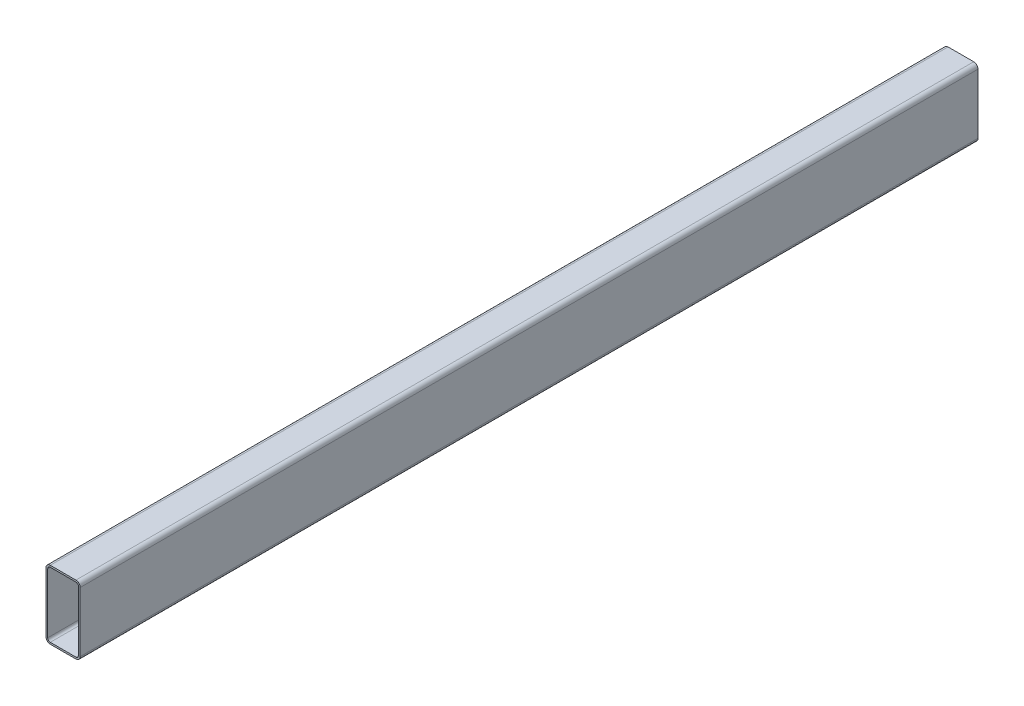
ISO-10303-21;
HEADER;
FILE_DESCRIPTION(('STEP AP214'),'2;1');
FILE_NAME('part.step','',(''),(''),'','','');
FILE_SCHEMA(('AUTOMOTIVE_DESIGN { 1 0 10303 214 1 1 1 1 }'));
ENDSEC;
DATA;
#1=APPLICATION_CONTEXT('core data for automotive mechanical design processes');
#2=APPLICATION_PROTOCOL_DEFINITION('international standard','automotive_design',2000,#1);
#3=PRODUCT_CONTEXT('',#1,'mechanical');
#4=PRODUCT('Part','Part','',(#3));
#5=PRODUCT_RELATED_PRODUCT_CATEGORY('part','',(#4));
#6=PRODUCT_DEFINITION_FORMATION('','',#4);
#7=PRODUCT_DEFINITION_CONTEXT('part definition',#1,'design');
#8=PRODUCT_DEFINITION('design','',#6,#7);
#9=PRODUCT_DEFINITION_SHAPE('','',#8);
#10=(LENGTH_UNIT() NAMED_UNIT(*) SI_UNIT(.MILLI.,.METRE.));
#11=(NAMED_UNIT(*) PLANE_ANGLE_UNIT() SI_UNIT($,.RADIAN.));
#12=(NAMED_UNIT(*) SI_UNIT($,.STERADIAN.) SOLID_ANGLE_UNIT());
#13=UNCERTAINTY_MEASURE_WITH_UNIT(LENGTH_MEASURE(1.E-05),#10,'distance_accuracy_value','');
#14=(GEOMETRIC_REPRESENTATION_CONTEXT(3) GLOBAL_UNCERTAINTY_ASSIGNED_CONTEXT((#13)) GLOBAL_UNIT_ASSIGNED_CONTEXT((#10,
#11,#12)) REPRESENTATION_CONTEXT('',''));
#15=CARTESIAN_POINT('',(0.,0.,0.));
#16=DIRECTION('',(0.,0.,1.));
#17=DIRECTION('',(1.,0.,0.));
#18=AXIS2_PLACEMENT_3D('',#15,#16,#17);
#19=CARTESIAN_POINT('',(15.,-35.,1050.));
#20=DIRECTION('',(0.,0.,1.));
#21=DIRECTION('',(1.,0.,0.));
#22=AXIS2_PLACEMENT_3D('',#19,#20,#21);
#23=PLANE('',#22);
#24=CARTESIAN_POINT('',(15.,-35.,1050.));
#25=DIRECTION('',(0.,0.,1.));
#26=DIRECTION('',(1.,0.,0.));
#27=AXIS2_PLACEMENT_3D('',#24,#25,#26);
#28=CIRCLE('',#27,5.);
#29=CARTESIAN_POINT('',(15.,-40.,1050.));
#30=VERTEX_POINT('',#29);
#31=CARTESIAN_POINT('',(20.,-35.,1050.));
#32=VERTEX_POINT('',#31);
#33=EDGE_CURVE('E213',#30,#32,#28,.T.);
#34=ORIENTED_EDGE('',*,*,#33,.T.);
#35=DIRECTION('',(0.,1.,0.));
#36=VECTOR('',#35,1.);
#37=CARTESIAN_POINT('',(20.,-35.,1050.));
#38=LINE('',#37,#36);
#39=CARTESIAN_POINT('',(20.,35.,1050.));
#40=VERTEX_POINT('',#39);
#41=EDGE_CURVE('E216',#32,#40,#38,.T.);
#42=ORIENTED_EDGE('',*,*,#41,.T.);
#43=CARTESIAN_POINT('',(15.,35.,1050.));
#44=DIRECTION('',(0.,0.,1.));
#45=DIRECTION('',(-1.,0.,0.));
#46=AXIS2_PLACEMENT_3D('',#43,#44,#45);
#47=CIRCLE('',#46,5.);
#48=CARTESIAN_POINT('',(15.,40.,1050.));
#49=VERTEX_POINT('',#48);
#50=EDGE_CURVE('E219',#40,#49,#47,.T.);
#51=ORIENTED_EDGE('',*,*,#50,.T.);
#52=DIRECTION('',(-1.,0.,0.));
#53=VECTOR('',#52,1.);
#54=CARTESIAN_POINT('',(-15.,40.,1050.));
#55=LINE('',#54,#53);
#56=CARTESIAN_POINT('',(-15.,40.,1050.));
#57=VERTEX_POINT('',#56);
#58=EDGE_CURVE('E221',#49,#57,#55,.T.);
#59=ORIENTED_EDGE('',*,*,#58,.T.);
#60=CARTESIAN_POINT('',(-15.,35.,1050.));
#61=DIRECTION('',(0.,0.,1.));
#62=DIRECTION('',(-1.,0.,0.));
#63=AXIS2_PLACEMENT_3D('',#60,#61,#62);
#64=CIRCLE('',#63,5.);
#65=CARTESIAN_POINT('',(-20.,35.,1050.));
#66=VERTEX_POINT('',#65);
#67=EDGE_CURVE('E223',#57,#66,#64,.T.);
#68=ORIENTED_EDGE('',*,*,#67,.T.);
#69=DIRECTION('',(0.,-1.,0.));
#70=VECTOR('',#69,1.);
#71=CARTESIAN_POINT('',(-20.,-35.,1050.));
#72=LINE('',#71,#70);
#73=CARTESIAN_POINT('',(-20.,-35.,1050.));
#74=VERTEX_POINT('',#73);
#75=EDGE_CURVE('E225',#66,#74,#72,.T.);
#76=ORIENTED_EDGE('',*,*,#75,.T.);
#77=CARTESIAN_POINT('',(-15.,-35.,1050.));
#78=DIRECTION('',(0.,0.,1.));
#79=DIRECTION('',(-1.,0.,0.));
#80=AXIS2_PLACEMENT_3D('',#77,#78,#79);
#81=CIRCLE('',#80,5.);
#82=CARTESIAN_POINT('',(-15.,-40.,1050.));
#83=VERTEX_POINT('',#82);
#84=EDGE_CURVE('E227',#74,#83,#81,.T.);
#85=ORIENTED_EDGE('',*,*,#84,.T.);
#86=DIRECTION('',(1.,0.,0.));
#87=VECTOR('',#86,1.);
#88=CARTESIAN_POINT('',(-15.,-40.,1050.));
#89=LINE('',#88,#87);
#90=EDGE_CURVE('E229',#83,#30,#89,.T.);
#91=ORIENTED_EDGE('',*,*,#90,.T.);
#92=EDGE_LOOP('',(#34,#42,#51,#59,#68,#76,#85,#91));
#93=FACE_BOUND('',#92,.T.);
#94=DIRECTION('',(1.,0.,0.));
#95=VECTOR('',#94,1.);
#96=CARTESIAN_POINT('',(-15.,-38.,1050.));
#97=LINE('',#96,#95);
#98=CARTESIAN_POINT('',(-15.,-38.,1050.));
#99=VERTEX_POINT('',#98);
#100=CARTESIAN_POINT('',(15.,-38.,1050.));
#101=VERTEX_POINT('',#100);
#102=EDGE_CURVE('E156',#99,#101,#97,.T.);
#103=ORIENTED_EDGE('',*,*,#102,.F.);
#104=CARTESIAN_POINT('',(-15.,-35.,1050.));
#105=DIRECTION('',(0.,0.,1.));
#106=DIRECTION('',(-1.,0.,0.));
#107=AXIS2_PLACEMENT_3D('',#104,#105,#106);
#108=CIRCLE('',#107,3.);
#109=CARTESIAN_POINT('',(-18.,-35.,1050.));
#110=VERTEX_POINT('',#109);
#111=EDGE_CURVE('E148',#110,#99,#108,.T.);
#112=ORIENTED_EDGE('',*,*,#111,.F.);
#113=DIRECTION('',(0.,-1.,0.));
#114=VECTOR('',#113,1.);
#115=CARTESIAN_POINT('',(-18.,-35.,1050.));
#116=LINE('',#115,#114);
#117=CARTESIAN_POINT('',(-18.,35.,1050.));
#118=VERTEX_POINT('',#117);
#119=EDGE_CURVE('E181',#118,#110,#116,.T.);
#120=ORIENTED_EDGE('',*,*,#119,.F.);
#121=CARTESIAN_POINT('',(-15.,35.,1050.));
#122=DIRECTION('',(0.,0.,1.));
#123=DIRECTION('',(-1.,0.,0.));
#124=AXIS2_PLACEMENT_3D('',#121,#122,#123);
#125=CIRCLE('',#124,3.);
#126=CARTESIAN_POINT('',(-15.,38.,1050.));
#127=VERTEX_POINT('',#126);
#128=EDGE_CURVE('E179',#127,#118,#125,.T.);
#129=ORIENTED_EDGE('',*,*,#128,.F.);
#130=DIRECTION('',(-1.,0.,0.));
#131=VECTOR('',#130,1.);
#132=CARTESIAN_POINT('',(-15.,38.,1050.));
#133=LINE('',#132,#131);
#134=CARTESIAN_POINT('',(15.,38.,1050.));
#135=VERTEX_POINT('',#134);
#136=EDGE_CURVE('E177',#135,#127,#133,.T.);
#137=ORIENTED_EDGE('',*,*,#136,.F.);
#138=CARTESIAN_POINT('',(15.,35.,1050.));
#139=DIRECTION('',(0.,0.,1.));
#140=DIRECTION('',(-1.,0.,0.));
#141=AXIS2_PLACEMENT_3D('',#138,#139,#140);
#142=CIRCLE('',#141,3.);
#143=CARTESIAN_POINT('',(18.,35.,1050.));
#144=VERTEX_POINT('',#143);
#145=EDGE_CURVE('E175',#144,#135,#142,.T.);
#146=ORIENTED_EDGE('',*,*,#145,.F.);
#147=DIRECTION('',(0.,1.,0.));
#148=VECTOR('',#147,1.);
#149=CARTESIAN_POINT('',(18.,-35.,1050.));
#150=LINE('',#149,#148);
#151=CARTESIAN_POINT('',(18.,-35.,1050.));
#152=VERTEX_POINT('',#151);
#153=EDGE_CURVE('E171',#152,#144,#150,.T.);
#154=ORIENTED_EDGE('',*,*,#153,.F.);
#155=CARTESIAN_POINT('',(15.,-35.,1050.));
#156=DIRECTION('',(0.,0.,1.));
#157=DIRECTION('',(1.,0.,0.));
#158=AXIS2_PLACEMENT_3D('',#155,#156,#157);
#159=CIRCLE('',#158,3.);
#160=EDGE_CURVE('E169',#101,#152,#159,.T.);
#161=ORIENTED_EDGE('',*,*,#160,.F.);
#162=EDGE_LOOP('',(#103,#112,#120,#129,#137,#146,#154,#161));
#163=FACE_BOUND('',#162,.T.);
#164=ADVANCED_FACE('F35',(#93,#163),#23,.T.);
#165=CARTESIAN_POINT('',(15.,-35.,0.));
#166=DIRECTION('',(0.,0.,1.));
#167=DIRECTION('',(1.,0.,0.));
#168=AXIS2_PLACEMENT_3D('',#165,#166,#167);
#169=PLANE('',#168);
#170=CARTESIAN_POINT('',(15.,-35.,0.));
#171=DIRECTION('',(0.,0.,1.));
#172=DIRECTION('',(1.,0.,0.));
#173=AXIS2_PLACEMENT_3D('',#170,#171,#172);
#174=CIRCLE('',#173,5.);
#175=CARTESIAN_POINT('',(15.,-40.,0.));
#176=VERTEX_POINT('',#175);
#177=CARTESIAN_POINT('',(20.,-35.,0.));
#178=VERTEX_POINT('',#177);
#179=EDGE_CURVE('E164',#176,#178,#174,.T.);
#180=ORIENTED_EDGE('',*,*,#179,.F.);
#181=DIRECTION('',(1.,0.,0.));
#182=VECTOR('',#181,1.);
#183=CARTESIAN_POINT('',(-15.,-40.,0.));
#184=LINE('',#183,#182);
#185=CARTESIAN_POINT('',(-15.,-40.,0.));
#186=VERTEX_POINT('',#185);
#187=EDGE_CURVE('E217',#186,#176,#184,.T.);
#188=ORIENTED_EDGE('',*,*,#187,.F.);
#189=CARTESIAN_POINT('',(-15.,-35.,0.));
#190=DIRECTION('',(0.,0.,1.));
#191=DIRECTION('',(-1.,0.,0.));
#192=AXIS2_PLACEMENT_3D('',#189,#190,#191);
#193=CIRCLE('',#192,5.);
#194=CARTESIAN_POINT('',(-20.,-35.,0.));
#195=VERTEX_POINT('',#194);
#196=EDGE_CURVE('E244',#195,#186,#193,.T.);
#197=ORIENTED_EDGE('',*,*,#196,.F.);
#198=DIRECTION('',(0.,-1.,0.));
#199=VECTOR('',#198,1.);
#200=CARTESIAN_POINT('',(-20.,-35.,0.));
#201=LINE('',#200,#199);
#202=CARTESIAN_POINT('',(-20.,35.,0.));
#203=VERTEX_POINT('',#202);
#204=EDGE_CURVE('E242',#203,#195,#201,.T.);
#205=ORIENTED_EDGE('',*,*,#204,.F.);
#206=CARTESIAN_POINT('',(-15.,35.,0.));
#207=DIRECTION('',(0.,0.,1.));
#208=DIRECTION('',(-1.,0.,0.));
#209=AXIS2_PLACEMENT_3D('',#206,#207,#208);
#210=CIRCLE('',#209,5.);
#211=CARTESIAN_POINT('',(-15.,40.,0.));
#212=VERTEX_POINT('',#211);
#213=EDGE_CURVE('E240',#212,#203,#210,.T.);
#214=ORIENTED_EDGE('',*,*,#213,.F.);
#215=DIRECTION('',(-1.,0.,0.));
#216=VECTOR('',#215,1.);
#217=CARTESIAN_POINT('',(-15.,40.,0.));
#218=LINE('',#217,#216);
#219=CARTESIAN_POINT('',(15.,40.,0.));
#220=VERTEX_POINT('',#219);
#221=EDGE_CURVE('E238',#220,#212,#218,.T.);
#222=ORIENTED_EDGE('',*,*,#221,.F.);
#223=CARTESIAN_POINT('',(15.,35.,0.));
#224=DIRECTION('',(0.,0.,1.));
#225=DIRECTION('',(-1.,0.,0.));
#226=AXIS2_PLACEMENT_3D('',#223,#224,#225);
#227=CIRCLE('',#226,5.);
#228=CARTESIAN_POINT('',(20.,35.,0.));
#229=VERTEX_POINT('',#228);
#230=EDGE_CURVE('E236',#229,#220,#227,.T.);
#231=ORIENTED_EDGE('',*,*,#230,.F.);
#232=DIRECTION('',(0.,1.,0.));
#233=VECTOR('',#232,1.);
#234=CARTESIAN_POINT('',(20.,-35.,0.));
#235=LINE('',#234,#233);
#236=EDGE_CURVE('E234',#178,#229,#235,.T.);
#237=ORIENTED_EDGE('',*,*,#236,.F.);
#238=EDGE_LOOP('',(#180,#188,#197,#205,#214,#222,#231,#237));
#239=FACE_BOUND('',#238,.T.);
#240=CARTESIAN_POINT('',(-15.,-35.,0.));
#241=DIRECTION('',(0.,0.,1.));
#242=DIRECTION('',(-1.,0.,0.));
#243=AXIS2_PLACEMENT_3D('',#240,#241,#242);
#244=CIRCLE('',#243,3.);
#245=CARTESIAN_POINT('',(-18.,-35.,0.));
#246=VERTEX_POINT('',#245);
#247=CARTESIAN_POINT('',(-15.,-38.,0.));
#248=VERTEX_POINT('',#247);
#249=EDGE_CURVE('E58',#246,#248,#244,.T.);
#250=ORIENTED_EDGE('',*,*,#249,.T.);
#251=DIRECTION('',(1.,0.,0.));
#252=VECTOR('',#251,1.);
#253=CARTESIAN_POINT('',(-15.,-38.,0.));
#254=LINE('',#253,#252);
#255=CARTESIAN_POINT('',(15.,-38.,0.));
#256=VERTEX_POINT('',#255);
#257=EDGE_CURVE('E163',#248,#256,#254,.T.);
#258=ORIENTED_EDGE('',*,*,#257,.T.);
#259=CARTESIAN_POINT('',(15.,-35.,0.));
#260=DIRECTION('',(0.,0.,1.));
#261=DIRECTION('',(1.,0.,0.));
#262=AXIS2_PLACEMENT_3D('',#259,#260,#261);
#263=CIRCLE('',#262,3.);
#264=CARTESIAN_POINT('',(18.,-35.,0.));
#265=VERTEX_POINT('',#264);
#266=EDGE_CURVE('E185',#256,#265,#263,.T.);
#267=ORIENTED_EDGE('',*,*,#266,.T.);
#268=DIRECTION('',(0.,1.,0.));
#269=VECTOR('',#268,1.);
#270=CARTESIAN_POINT('',(18.,-35.,0.));
#271=LINE('',#270,#269);
#272=CARTESIAN_POINT('',(18.,35.,0.));
#273=VERTEX_POINT('',#272);
#274=EDGE_CURVE('E188',#265,#273,#271,.T.);
#275=ORIENTED_EDGE('',*,*,#274,.T.);
#276=CARTESIAN_POINT('',(15.,35.,0.));
#277=DIRECTION('',(0.,0.,1.));
#278=DIRECTION('',(-1.,0.,0.));
#279=AXIS2_PLACEMENT_3D('',#276,#277,#278);
#280=CIRCLE('',#279,3.);
#281=CARTESIAN_POINT('',(15.,38.,0.));
#282=VERTEX_POINT('',#281);
#283=EDGE_CURVE('E191',#273,#282,#280,.T.);
#284=ORIENTED_EDGE('',*,*,#283,.T.);
#285=DIRECTION('',(-1.,0.,0.));
#286=VECTOR('',#285,1.);
#287=CARTESIAN_POINT('',(-15.,38.,0.));
#288=LINE('',#287,#286);
#289=CARTESIAN_POINT('',(-15.,38.,0.));
#290=VERTEX_POINT('',#289);
#291=EDGE_CURVE('E194',#282,#290,#288,.T.);
#292=ORIENTED_EDGE('',*,*,#291,.T.);
#293=CARTESIAN_POINT('',(-15.,35.,0.));
#294=DIRECTION('',(0.,0.,1.));
#295=DIRECTION('',(-1.,0.,0.));
#296=AXIS2_PLACEMENT_3D('',#293,#294,#295);
#297=CIRCLE('',#296,3.);
#298=CARTESIAN_POINT('',(-18.,35.,0.));
#299=VERTEX_POINT('',#298);
#300=EDGE_CURVE('E197',#290,#299,#297,.T.);
#301=ORIENTED_EDGE('',*,*,#300,.T.);
#302=DIRECTION('',(0.,-1.,0.));
#303=VECTOR('',#302,1.);
#304=CARTESIAN_POINT('',(-18.,-35.,0.));
#305=LINE('',#304,#303);
#306=EDGE_CURVE('E157',#299,#246,#305,.T.);
#307=ORIENTED_EDGE('',*,*,#306,.T.);
#308=EDGE_LOOP('',(#250,#258,#267,#275,#284,#292,#301,#307));
#309=FACE_BOUND('',#308,.T.);
#310=ADVANCED_FACE('F274',(#239,#309),#169,.F.);
#311=CARTESIAN_POINT('',(15.,-35.,1050.));
#312=DIRECTION('',(0.,0.,-1.));
#313=DIRECTION('',(-1.,0.,0.));
#314=AXIS2_PLACEMENT_3D('',#311,#312,#313);
#315=CYLINDRICAL_SURFACE('',#314,5.);
#316=ORIENTED_EDGE('',*,*,#179,.T.);
#317=DIRECTION('',(0.,0.,-1.));
#318=VECTOR('',#317,1.);
#319=CARTESIAN_POINT('',(20.,-35.,1050.));
#320=LINE('',#319,#318);
#321=EDGE_CURVE('E11',#32,#178,#320,.T.);
#322=ORIENTED_EDGE('',*,*,#321,.F.);
#323=ORIENTED_EDGE('',*,*,#33,.F.);
#324=DIRECTION('',(0.,0.,-1.));
#325=VECTOR('',#324,1.);
#326=CARTESIAN_POINT('',(15.,-40.,1050.));
#327=LINE('',#326,#325);
#328=EDGE_CURVE('E231',#30,#176,#327,.T.);
#329=ORIENTED_EDGE('',*,*,#328,.T.);
#330=EDGE_LOOP('',(#316,#322,#323,#329));
#331=FACE_BOUND('',#330,.T.);
#332=ADVANCED_FACE('F37',(#331),#315,.T.);
#333=CARTESIAN_POINT('',(20.,-35.,1050.));
#334=DIRECTION('',(-1.,0.,0.));
#335=DIRECTION('',(0.,0.,1.));
#336=AXIS2_PLACEMENT_3D('',#333,#334,#335);
#337=PLANE('',#336);
#338=ORIENTED_EDGE('',*,*,#236,.T.);
#339=DIRECTION('',(0.,0.,-1.));
#340=VECTOR('',#339,1.);
#341=CARTESIAN_POINT('',(20.,35.,1050.));
#342=LINE('',#341,#340);
#343=EDGE_CURVE('E43',#40,#229,#342,.T.);
#344=ORIENTED_EDGE('',*,*,#343,.F.);
#345=ORIENTED_EDGE('',*,*,#41,.F.);
#346=ORIENTED_EDGE('',*,*,#321,.T.);
#347=EDGE_LOOP('',(#338,#344,#345,#346));
#348=FACE_BOUND('',#347,.T.);
#349=ADVANCED_FACE('F291',(#348),#337,.F.);
#350=CARTESIAN_POINT('',(15.,35.,1050.));
#351=DIRECTION('',(0.,0.,-1.));
#352=DIRECTION('',(-1.,0.,0.));
#353=AXIS2_PLACEMENT_3D('',#350,#351,#352);
#354=CYLINDRICAL_SURFACE('',#353,5.);
#355=ORIENTED_EDGE('',*,*,#230,.T.);
#356=DIRECTION('',(0.,0.,-1.));
#357=VECTOR('',#356,1.);
#358=CARTESIAN_POINT('',(15.,40.,1050.));
#359=LINE('',#358,#357);
#360=EDGE_CURVE('E261',#49,#220,#359,.T.);
#361=ORIENTED_EDGE('',*,*,#360,.F.);
#362=ORIENTED_EDGE('',*,*,#50,.F.);
#363=ORIENTED_EDGE('',*,*,#343,.T.);
#364=EDGE_LOOP('',(#355,#361,#362,#363));
#365=FACE_BOUND('',#364,.T.);
#366=ADVANCED_FACE('F268',(#365),#354,.T.);
#367=CARTESIAN_POINT('',(-15.,40.,1050.));
#368=DIRECTION('',(0.,-1.,0.));
#369=DIRECTION('',(0.,0.,-1.));
#370=AXIS2_PLACEMENT_3D('',#367,#368,#369);
#371=PLANE('',#370);
#372=ORIENTED_EDGE('',*,*,#221,.T.);
#373=DIRECTION('',(0.,0.,-1.));
#374=VECTOR('',#373,1.);
#375=CARTESIAN_POINT('',(-15.,40.,1050.));
#376=LINE('',#375,#374);
#377=EDGE_CURVE('E258',#57,#212,#376,.T.);
#378=ORIENTED_EDGE('',*,*,#377,.F.);
#379=ORIENTED_EDGE('',*,*,#58,.F.);
#380=ORIENTED_EDGE('',*,*,#360,.T.);
#381=EDGE_LOOP('',(#372,#378,#379,#380));
#382=FACE_BOUND('',#381,.T.);
#383=ADVANCED_FACE('F280',(#382),#371,.F.);
#384=CARTESIAN_POINT('',(-15.,35.,1050.));
#385=DIRECTION('',(0.,0.,-1.));
#386=DIRECTION('',(-1.,0.,0.));
#387=AXIS2_PLACEMENT_3D('',#384,#385,#386);
#388=CYLINDRICAL_SURFACE('',#387,5.);
#389=ORIENTED_EDGE('',*,*,#213,.T.);
#390=DIRECTION('',(0.,0.,-1.));
#391=VECTOR('',#390,1.);
#392=CARTESIAN_POINT('',(-20.,35.,1050.));
#393=LINE('',#392,#391);
#394=EDGE_CURVE('E255',#66,#203,#393,.T.);
#395=ORIENTED_EDGE('',*,*,#394,.F.);
#396=ORIENTED_EDGE('',*,*,#67,.F.);
#397=ORIENTED_EDGE('',*,*,#377,.T.);
#398=EDGE_LOOP('',(#389,#395,#396,#397));
#399=FACE_BOUND('',#398,.T.);
#400=ADVANCED_FACE('F284',(#399),#388,.T.);
#401=CARTESIAN_POINT('',(-20.,-35.,1050.));
#402=DIRECTION('',(1.,0.,0.));
#403=DIRECTION('',(0.,0.,-1.));
#404=AXIS2_PLACEMENT_3D('',#401,#402,#403);
#405=PLANE('',#404);
#406=ORIENTED_EDGE('',*,*,#204,.T.);
#407=DIRECTION('',(0.,0.,-1.));
#408=VECTOR('',#407,1.);
#409=CARTESIAN_POINT('',(-20.,-35.,1050.));
#410=LINE('',#409,#408);
#411=EDGE_CURVE('E252',#74,#195,#410,.T.);
#412=ORIENTED_EDGE('',*,*,#411,.F.);
#413=ORIENTED_EDGE('',*,*,#75,.F.);
#414=ORIENTED_EDGE('',*,*,#394,.T.);
#415=EDGE_LOOP('',(#406,#412,#413,#414));
#416=FACE_BOUND('',#415,.T.);
#417=ADVANCED_FACE('F304',(#416),#405,.F.);
#418=CARTESIAN_POINT('',(-15.,-35.,1050.));
#419=DIRECTION('',(0.,0.,-1.));
#420=DIRECTION('',(-1.,0.,0.));
#421=AXIS2_PLACEMENT_3D('',#418,#419,#420);
#422=CYLINDRICAL_SURFACE('',#421,5.);
#423=ORIENTED_EDGE('',*,*,#196,.T.);
#424=DIRECTION('',(0.,0.,-1.));
#425=VECTOR('',#424,1.);
#426=CARTESIAN_POINT('',(-15.,-40.,1050.));
#427=LINE('',#426,#425);
#428=EDGE_CURVE('E249',#83,#186,#427,.T.);
#429=ORIENTED_EDGE('',*,*,#428,.F.);
#430=ORIENTED_EDGE('',*,*,#84,.F.);
#431=ORIENTED_EDGE('',*,*,#411,.T.);
#432=EDGE_LOOP('',(#423,#429,#430,#431));
#433=FACE_BOUND('',#432,.T.);
#434=ADVANCED_FACE('F302',(#433),#422,.T.);
#435=CARTESIAN_POINT('',(-15.,-40.,1050.));
#436=DIRECTION('',(0.,1.,0.));
#437=DIRECTION('',(-1.,0.,0.));
#438=AXIS2_PLACEMENT_3D('',#435,#436,#437);
#439=PLANE('',#438);
#440=ORIENTED_EDGE('',*,*,#187,.T.);
#441=ORIENTED_EDGE('',*,*,#328,.F.);
#442=ORIENTED_EDGE('',*,*,#90,.F.);
#443=ORIENTED_EDGE('',*,*,#428,.T.);
#444=EDGE_LOOP('',(#440,#441,#442,#443));
#445=FACE_BOUND('',#444,.T.);
#446=ADVANCED_FACE('F297',(#445),#439,.F.);
#447=CARTESIAN_POINT('',(-15.,-35.,1050.));
#448=DIRECTION('',(0.,0.,-1.));
#449=DIRECTION('',(-1.,0.,0.));
#450=AXIS2_PLACEMENT_3D('',#447,#448,#449);
#451=CYLINDRICAL_SURFACE('',#450,3.);
#452=ORIENTED_EDGE('',*,*,#249,.F.);
#453=DIRECTION('',(0.,0.,-1.));
#454=VECTOR('',#453,1.);
#455=CARTESIAN_POINT('',(-18.,-35.,1050.));
#456=LINE('',#455,#454);
#457=EDGE_CURVE('E152',#110,#246,#456,.T.);
#458=ORIENTED_EDGE('',*,*,#457,.F.);
#459=ORIENTED_EDGE('',*,*,#111,.T.);
#460=DIRECTION('',(0.,0.,-1.));
#461=VECTOR('',#460,1.);
#462=CARTESIAN_POINT('',(-15.,-38.,1050.));
#463=LINE('',#462,#461);
#464=EDGE_CURVE('E151',#99,#248,#463,.T.);
#465=ORIENTED_EDGE('',*,*,#464,.T.);
#466=EDGE_LOOP('',(#452,#458,#459,#465));
#467=FACE_BOUND('',#466,.T.);
#468=ADVANCED_FACE('F150',(#467),#451,.F.);
#469=CARTESIAN_POINT('',(-15.,-38.,1050.));
#470=DIRECTION('',(0.,1.,0.));
#471=DIRECTION('',(-1.,0.,0.));
#472=AXIS2_PLACEMENT_3D('',#469,#470,#471);
#473=PLANE('',#472);
#474=ORIENTED_EDGE('',*,*,#257,.F.);
#475=ORIENTED_EDGE('',*,*,#464,.F.);
#476=ORIENTED_EDGE('',*,*,#102,.T.);
#477=DIRECTION('',(0.,0.,-1.));
#478=VECTOR('',#477,1.);
#479=CARTESIAN_POINT('',(15.,-38.,1050.));
#480=LINE('',#479,#478);
#481=EDGE_CURVE('E165',#101,#256,#480,.T.);
#482=ORIENTED_EDGE('',*,*,#481,.T.);
#483=EDGE_LOOP('',(#474,#475,#476,#482));
#484=FACE_BOUND('',#483,.T.);
#485=ADVANCED_FACE('F160',(#484),#473,.T.);
#486=CARTESIAN_POINT('',(15.,-35.,1050.));
#487=DIRECTION('',(0.,0.,-1.));
#488=DIRECTION('',(-1.,0.,0.));
#489=AXIS2_PLACEMENT_3D('',#486,#487,#488);
#490=CYLINDRICAL_SURFACE('',#489,3.);
#491=ORIENTED_EDGE('',*,*,#266,.F.);
#492=ORIENTED_EDGE('',*,*,#481,.F.);
#493=ORIENTED_EDGE('',*,*,#160,.T.);
#494=DIRECTION('',(0.,0.,-1.));
#495=VECTOR('',#494,1.);
#496=CARTESIAN_POINT('',(18.,-35.,1050.));
#497=LINE('',#496,#495);
#498=EDGE_CURVE('E210',#152,#265,#497,.T.);
#499=ORIENTED_EDGE('',*,*,#498,.T.);
#500=EDGE_LOOP('',(#491,#492,#493,#499));
#501=FACE_BOUND('',#500,.T.);
#502=ADVANCED_FACE('F329',(#501),#490,.F.);
#503=CARTESIAN_POINT('',(18.,-35.,1050.));
#504=DIRECTION('',(-1.,0.,0.));
#505=DIRECTION('',(0.,0.,1.));
#506=AXIS2_PLACEMENT_3D('',#503,#504,#505);
#507=PLANE('',#506);
#508=ORIENTED_EDGE('',*,*,#274,.F.);
#509=ORIENTED_EDGE('',*,*,#498,.F.);
#510=ORIENTED_EDGE('',*,*,#153,.T.);
#511=DIRECTION('',(0.,0.,-1.));
#512=VECTOR('',#511,1.);
#513=CARTESIAN_POINT('',(18.,35.,1050.));
#514=LINE('',#513,#512);
#515=EDGE_CURVE('E208',#144,#273,#514,.T.);
#516=ORIENTED_EDGE('',*,*,#515,.T.);
#517=EDGE_LOOP('',(#508,#509,#510,#516));
#518=FACE_BOUND('',#517,.T.);
#519=ADVANCED_FACE('F333',(#518),#507,.T.);
#520=CARTESIAN_POINT('',(15.,35.,1050.));
#521=DIRECTION('',(0.,0.,-1.));
#522=DIRECTION('',(-1.,0.,0.));
#523=AXIS2_PLACEMENT_3D('',#520,#521,#522);
#524=CYLINDRICAL_SURFACE('',#523,3.);
#525=ORIENTED_EDGE('',*,*,#283,.F.);
#526=ORIENTED_EDGE('',*,*,#515,.F.);
#527=ORIENTED_EDGE('',*,*,#145,.T.);
#528=DIRECTION('',(0.,0.,-1.));
#529=VECTOR('',#528,1.);
#530=CARTESIAN_POINT('',(15.,38.,1050.));
#531=LINE('',#530,#529);
#532=EDGE_CURVE('E206',#135,#282,#531,.T.);
#533=ORIENTED_EDGE('',*,*,#532,.T.);
#534=EDGE_LOOP('',(#525,#526,#527,#533));
#535=FACE_BOUND('',#534,.T.);
#536=ADVANCED_FACE('F339',(#535),#524,.F.);
#537=CARTESIAN_POINT('',(-15.,38.,1050.));
#538=DIRECTION('',(0.,-1.,0.));
#539=DIRECTION('',(0.,0.,-1.));
#540=AXIS2_PLACEMENT_3D('',#537,#538,#539);
#541=PLANE('',#540);
#542=ORIENTED_EDGE('',*,*,#291,.F.);
#543=ORIENTED_EDGE('',*,*,#532,.F.);
#544=ORIENTED_EDGE('',*,*,#136,.T.);
#545=DIRECTION('',(0.,0.,-1.));
#546=VECTOR('',#545,1.);
#547=CARTESIAN_POINT('',(-15.,38.,1050.));
#548=LINE('',#547,#546);
#549=EDGE_CURVE('E204',#127,#290,#548,.T.);
#550=ORIENTED_EDGE('',*,*,#549,.T.);
#551=EDGE_LOOP('',(#542,#543,#544,#550));
#552=FACE_BOUND('',#551,.T.);
#553=ADVANCED_FACE('F343',(#552),#541,.T.);
#554=CARTESIAN_POINT('',(-15.,35.,1050.));
#555=DIRECTION('',(0.,0.,-1.));
#556=DIRECTION('',(-1.,0.,0.));
#557=AXIS2_PLACEMENT_3D('',#554,#555,#556);
#558=CYLINDRICAL_SURFACE('',#557,3.);
#559=ORIENTED_EDGE('',*,*,#300,.F.);
#560=ORIENTED_EDGE('',*,*,#549,.F.);
#561=ORIENTED_EDGE('',*,*,#128,.T.);
#562=DIRECTION('',(0.,0.,-1.));
#563=VECTOR('',#562,1.);
#564=CARTESIAN_POINT('',(-18.,35.,1050.));
#565=LINE('',#564,#563);
#566=EDGE_CURVE('E50',#118,#299,#565,.T.);
#567=ORIENTED_EDGE('',*,*,#566,.T.);
#568=EDGE_LOOP('',(#559,#560,#561,#567));
#569=FACE_BOUND('',#568,.T.);
#570=ADVANCED_FACE('F347',(#569),#558,.F.);
#571=CARTESIAN_POINT('',(-18.,-35.,1050.));
#572=DIRECTION('',(1.,0.,0.));
#573=DIRECTION('',(0.,0.,-1.));
#574=AXIS2_PLACEMENT_3D('',#571,#572,#573);
#575=PLANE('',#574);
#576=ORIENTED_EDGE('',*,*,#306,.F.);
#577=ORIENTED_EDGE('',*,*,#566,.F.);
#578=ORIENTED_EDGE('',*,*,#119,.T.);
#579=ORIENTED_EDGE('',*,*,#457,.T.);
#580=EDGE_LOOP('',(#576,#577,#578,#579));
#581=FACE_BOUND('',#580,.T.);
#582=ADVANCED_FACE('F351',(#581),#575,.T.);
#583=CLOSED_SHELL('',(#164,#310,#332,#349,#366,#383,#400,#417,#434,#446,#468,#485,#502,#519,
#536,#553,#570,#582));
#584=MANIFOLD_SOLID_BREP('B2',#583);
#585=ADVANCED_BREP_SHAPE_REPRESENTATION('',(#18,#584),#14);
#586=SHAPE_DEFINITION_REPRESENTATION(#9,#585);
ENDSEC;
END-ISO-10303-21;
